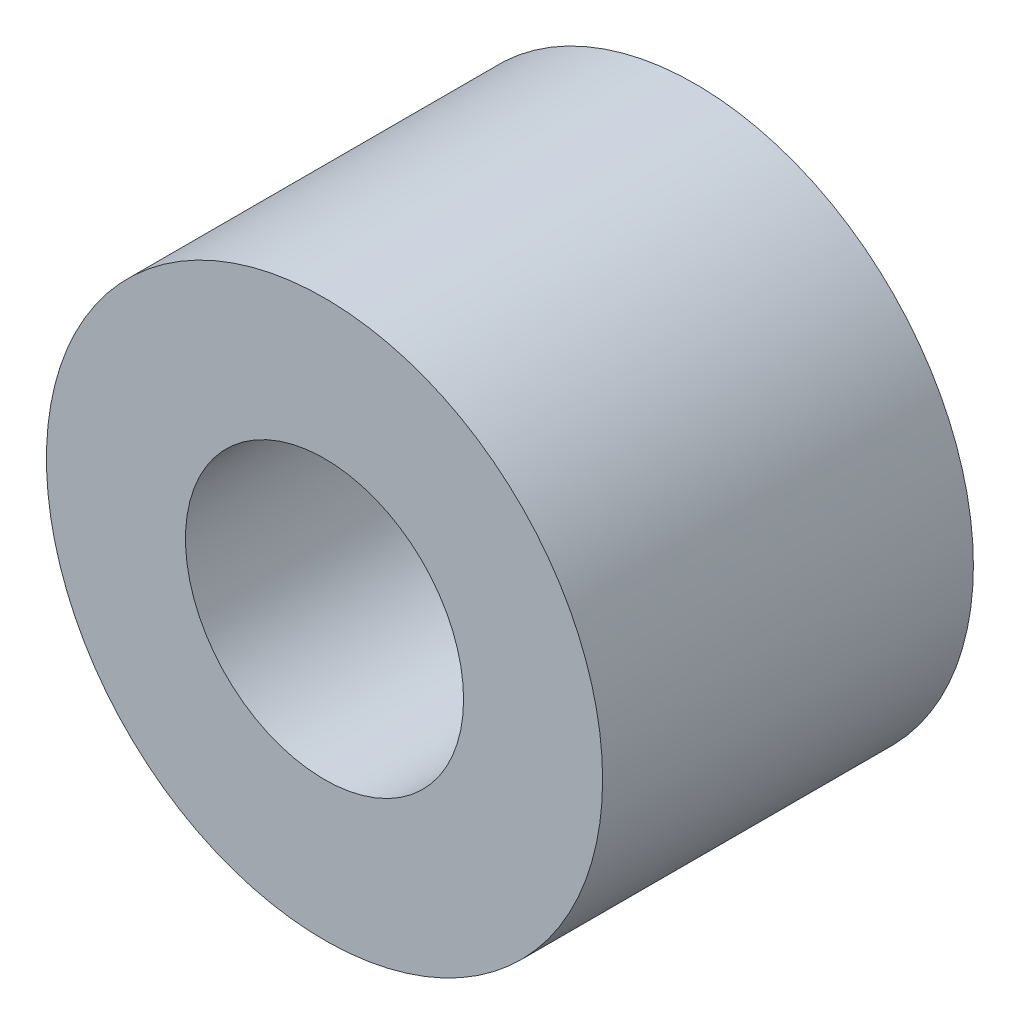
ISO-10303-21;
HEADER;
FILE_DESCRIPTION(('STEP AP214'),'2;1');
FILE_NAME('part.step','',(''),(''),'','','');
FILE_SCHEMA(('AUTOMOTIVE_DESIGN { 1 0 10303 214 1 1 1 1 }'));
ENDSEC;
DATA;
#1=APPLICATION_CONTEXT('core data for automotive mechanical design processes');
#2=APPLICATION_PROTOCOL_DEFINITION('international standard','automotive_design',2000,#1);
#3=PRODUCT_CONTEXT('',#1,'mechanical');
#4=PRODUCT('Part','Part','',(#3));
#5=PRODUCT_RELATED_PRODUCT_CATEGORY('part','',(#4));
#6=PRODUCT_DEFINITION_FORMATION('','',#4);
#7=PRODUCT_DEFINITION_CONTEXT('part definition',#1,'design');
#8=PRODUCT_DEFINITION('design','',#6,#7);
#9=PRODUCT_DEFINITION_SHAPE('','',#8);
#10=(LENGTH_UNIT() NAMED_UNIT(*) SI_UNIT(.MILLI.,.METRE.));
#11=(NAMED_UNIT(*) PLANE_ANGLE_UNIT() SI_UNIT($,.RADIAN.));
#12=(NAMED_UNIT(*) SI_UNIT($,.STERADIAN.) SOLID_ANGLE_UNIT());
#13=UNCERTAINTY_MEASURE_WITH_UNIT(LENGTH_MEASURE(1.E-05),#10,'distance_accuracy_value','');
#14=(GEOMETRIC_REPRESENTATION_CONTEXT(3) GLOBAL_UNCERTAINTY_ASSIGNED_CONTEXT((#13)) GLOBAL_UNIT_ASSIGNED_CONTEXT((#10,
#11,#12)) REPRESENTATION_CONTEXT('',''));
#15=CARTESIAN_POINT('',(0.,0.,0.));
#16=DIRECTION('',(0.,0.,1.));
#17=DIRECTION('',(1.,0.,0.));
#18=AXIS2_PLACEMENT_3D('',#15,#16,#17);
#19=CARTESIAN_POINT('',(2.99999913845687,3.00000005741133,4.));
#20=DIRECTION('',(0.,0.,1.));
#21=DIRECTION('',(1.,0.,0.));
#22=AXIS2_PLACEMENT_3D('',#19,#20,#21);
#23=PLANE('',#22);
#24=CARTESIAN_POINT('',(2.99999913845687,3.00000005741133,4.));
#25=DIRECTION('',(0.,0.,1.));
#26=DIRECTION('',(1.,0.,0.));
#27=AXIS2_PLACEMENT_3D('',#24,#25,#26);
#28=CIRCLE('',#27,3.);
#29=CARTESIAN_POINT('',(5.99999913845687,3.00000005741133,4.));
#30=VERTEX_POINT('',#29);
#31=EDGE_CURVE('E10',#30,#30,#28,.T.);
#32=ORIENTED_EDGE('',*,*,#31,.T.);
#33=EDGE_LOOP('',(#32));
#34=FACE_BOUND('',#33,.T.);
#35=CARTESIAN_POINT('',(2.99999913845687,3.00000005741133,4.));
#36=DIRECTION('',(0.,0.,1.));
#37=DIRECTION('',(1.,0.,0.));
#38=AXIS2_PLACEMENT_3D('',#35,#36,#37);
#39=CIRCLE('',#38,1.5);
#40=CARTESIAN_POINT('',(4.49999913845687,3.00000005741133,4.));
#41=VERTEX_POINT('',#40);
#42=EDGE_CURVE('E41',#41,#41,#39,.T.);
#43=ORIENTED_EDGE('',*,*,#42,.F.);
#44=EDGE_LOOP('',(#43));
#45=FACE_BOUND('',#44,.T.);
#46=ADVANCED_FACE('F30',(#34,#45),#23,.T.);
#47=CARTESIAN_POINT('',(2.99999913845687,3.00000005741133,0.));
#48=DIRECTION('',(0.,0.,1.));
#49=DIRECTION('',(1.,0.,0.));
#50=AXIS2_PLACEMENT_3D('',#47,#48,#49);
#51=PLANE('',#50);
#52=CARTESIAN_POINT('',(2.99999913845687,3.00000005741133,0.));
#53=DIRECTION('',(0.,0.,1.));
#54=DIRECTION('',(1.,0.,0.));
#55=AXIS2_PLACEMENT_3D('',#52,#53,#54);
#56=CIRCLE('',#55,3.);
#57=CARTESIAN_POINT('',(5.99999913845687,3.00000005741133,0.));
#58=VERTEX_POINT('',#57);
#59=EDGE_CURVE('E34',#58,#58,#56,.T.);
#60=ORIENTED_EDGE('',*,*,#59,.F.);
#61=EDGE_LOOP('',(#60));
#62=FACE_BOUND('',#61,.T.);
#63=CARTESIAN_POINT('',(2.99999913845687,3.00000005741133,0.));
#64=DIRECTION('',(0.,0.,1.));
#65=DIRECTION('',(1.,0.,0.));
#66=AXIS2_PLACEMENT_3D('',#63,#64,#65);
#67=CIRCLE('',#66,1.5);
#68=CARTESIAN_POINT('',(4.49999913845687,3.00000005741133,0.));
#69=VERTEX_POINT('',#68);
#70=EDGE_CURVE('E43',#69,#69,#67,.T.);
#71=ORIENTED_EDGE('',*,*,#70,.T.);
#72=EDGE_LOOP('',(#71));
#73=FACE_BOUND('',#72,.T.);
#74=ADVANCED_FACE('F53',(#62,#73),#51,.F.);
#75=CARTESIAN_POINT('',(2.99999913845687,3.00000005741133,4.));
#76=DIRECTION('',(0.,0.,-1.));
#77=DIRECTION('',(-1.,0.,0.));
#78=AXIS2_PLACEMENT_3D('',#75,#76,#77);
#79=CYLINDRICAL_SURFACE('',#78,3.);
#80=ORIENTED_EDGE('',*,*,#31,.F.);
#81=EDGE_LOOP('',(#80));
#82=FACE_BOUND('',#81,.T.);
#83=ORIENTED_EDGE('',*,*,#59,.T.);
#84=EDGE_LOOP('',(#83));
#85=FACE_BOUND('',#84,.T.);
#86=ADVANCED_FACE('F32',(#82,#85),#79,.T.);
#87=CARTESIAN_POINT('',(2.99999913845687,3.00000005741133,4.));
#88=DIRECTION('',(0.,0.,-1.));
#89=DIRECTION('',(-1.,0.,0.));
#90=AXIS2_PLACEMENT_3D('',#87,#88,#89);
#91=CYLINDRICAL_SURFACE('',#90,1.5);
#92=ORIENTED_EDGE('',*,*,#42,.T.);
#93=EDGE_LOOP('',(#92));
#94=FACE_BOUND('',#93,.T.);
#95=ORIENTED_EDGE('',*,*,#70,.F.);
#96=EDGE_LOOP('',(#95));
#97=FACE_BOUND('',#96,.T.);
#98=ADVANCED_FACE('F49',(#94,#97),#91,.F.);
#99=CLOSED_SHELL('',(#46,#74,#86,#98));
#100=MANIFOLD_SOLID_BREP('B2',#99);
#101=ADVANCED_BREP_SHAPE_REPRESENTATION('',(#18,#100),#14);
#102=SHAPE_DEFINITION_REPRESENTATION(#9,#101);
ENDSEC;
END-ISO-10303-21;
